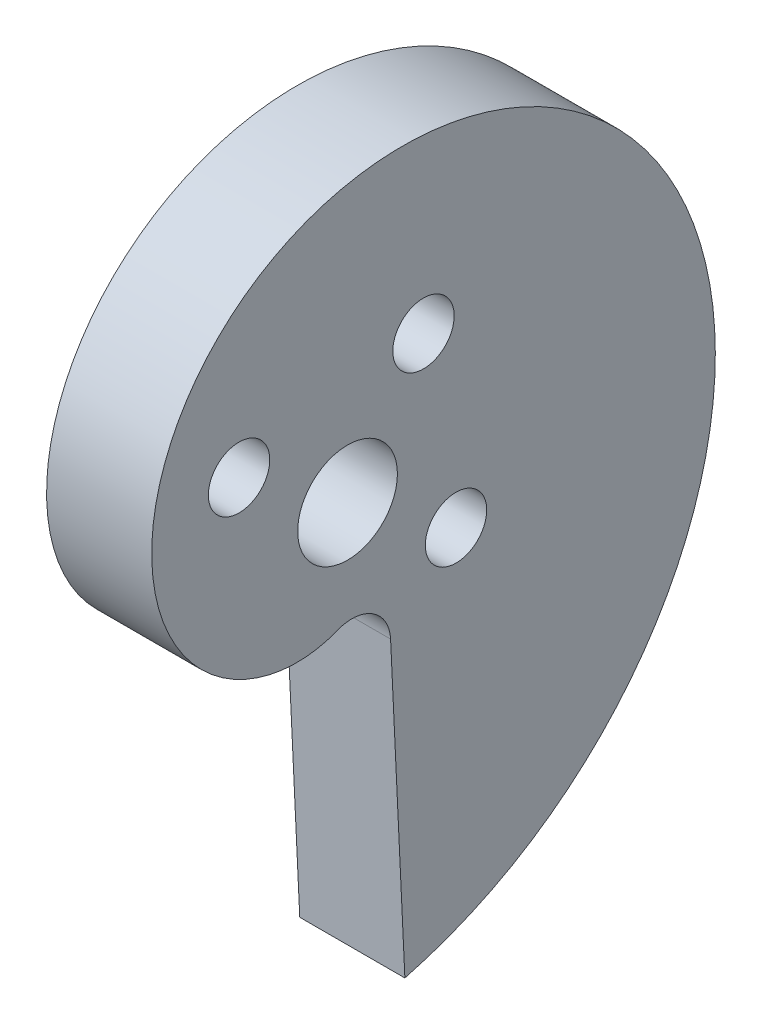
ISO-10303-21;
HEADER;
FILE_DESCRIPTION(('STEP AP214'),'2;1');
FILE_NAME('part.step','',(''),(''),'','','');
FILE_SCHEMA(('AUTOMOTIVE_DESIGN { 1 0 10303 214 1 1 1 1 }'));
ENDSEC;
DATA;
#1=APPLICATION_CONTEXT('core data for automotive mechanical design processes');
#2=APPLICATION_PROTOCOL_DEFINITION('international standard','automotive_design',2000,#1);
#3=PRODUCT_CONTEXT('',#1,'mechanical');
#4=PRODUCT('Part','Part','',(#3));
#5=PRODUCT_RELATED_PRODUCT_CATEGORY('part','',(#4));
#6=PRODUCT_DEFINITION_FORMATION('','',#4);
#7=PRODUCT_DEFINITION_CONTEXT('part definition',#1,'design');
#8=PRODUCT_DEFINITION('design','',#6,#7);
#9=PRODUCT_DEFINITION_SHAPE('','',#8);
#10=(LENGTH_UNIT() NAMED_UNIT(*) SI_UNIT(.MILLI.,.METRE.));
#11=(NAMED_UNIT(*) PLANE_ANGLE_UNIT() SI_UNIT($,.RADIAN.));
#12=(NAMED_UNIT(*) SI_UNIT($,.STERADIAN.) SOLID_ANGLE_UNIT());
#13=UNCERTAINTY_MEASURE_WITH_UNIT(LENGTH_MEASURE(1.E-05),#10,'distance_accuracy_value','');
#14=(GEOMETRIC_REPRESENTATION_CONTEXT(3) GLOBAL_UNCERTAINTY_ASSIGNED_CONTEXT((#13)) GLOBAL_UNIT_ASSIGNED_CONTEXT((#10,
#11,#12)) REPRESENTATION_CONTEXT('',''));
#15=CARTESIAN_POINT('',(0.,0.,0.));
#16=DIRECTION('',(0.,0.,1.));
#17=DIRECTION('',(1.,0.,0.));
#18=AXIS2_PLACEMENT_3D('',#15,#16,#17);
#19=CARTESIAN_POINT('',(6.35,16.3980040897592,0.208936694079273));
#20=DIRECTION('',(1.,0.,0.));
#21=DIRECTION('',(0.,0.,-1.));
#22=AXIS2_PLACEMENT_3D('',#19,#20,#21);
#23=PLANE('',#22);
#24=CARTESIAN_POINT('',(6.35,6.55321635431194,-4.58861149080837));
#25=DIRECTION('',(-1.,0.,0.));
#26=DIRECTION('',(0.,0.,1.));
#27=AXIS2_PLACEMENT_3D('',#24,#25,#26);
#28=CIRCLE('',#27,1.8542);
#29=CARTESIAN_POINT('',(6.35,6.55321635431194,-2.73441149080837));
#30=VERTEX_POINT('',#29);
#31=EDGE_CURVE('E138',#30,#30,#28,.T.);
#32=ORIENTED_EDGE('',*,*,#31,.T.);
#33=EDGE_LOOP('',(#32));
#34=FACE_BOUND('',#33,.T.);
#35=CARTESIAN_POINT('',(6.35,4.58861149080839,6.55321635431194));
#36=DIRECTION('',(-1.,0.,0.));
#37=DIRECTION('',(0.,0.,1.));
#38=AXIS2_PLACEMENT_3D('',#35,#36,#37);
#39=CIRCLE('',#38,1.8542);
#40=CARTESIAN_POINT('',(6.35,4.58861149080839,8.40741635431194));
#41=VERTEX_POINT('',#40);
#42=EDGE_CURVE('E142',#41,#41,#39,.T.);
#43=ORIENTED_EDGE('',*,*,#42,.T.);
#44=EDGE_LOOP('',(#43));
#45=FACE_BOUND('',#44,.T.);
#46=CARTESIAN_POINT('',(6.35,-4.58861149080837,-6.55321635431192));
#47=DIRECTION('',(-1.,0.,0.));
#48=DIRECTION('',(0.,0.,1.));
#49=AXIS2_PLACEMENT_3D('',#46,#47,#48);
#50=CIRCLE('',#49,1.8542);
#51=CARTESIAN_POINT('',(6.35,-4.58861149080837,-4.69901635431192));
#52=VERTEX_POINT('',#51);
#53=EDGE_CURVE('E145',#52,#52,#50,.T.);
#54=ORIENTED_EDGE('',*,*,#53,.T.);
#55=EDGE_LOOP('',(#54));
#56=FACE_BOUND('',#55,.T.);
#57=CARTESIAN_POINT('',(6.35,-26.6041786448891,-3.46411616806894));
#58=CARTESIAN_POINT('',(6.35,-26.5960990181453,-3.49393067135354));
#59=CARTESIAN_POINT('',(6.35,-26.5880156349324,-3.52374410868873));
#60=CARTESIAN_POINT('',(6.35,-26.5718488325451,-3.58337111594988));
#61=CARTESIAN_POINT('',(6.35,-26.5637654133707,-3.61318468587584));
#62=CARTESIAN_POINT('',(6.35,-26.5395261439436,-3.70262963202641));
#63=CARTESIAN_POINT('',(6.35,-26.5233815637382,-3.76226420628094));
#64=CARTESIAN_POINT('',(6.35,-26.4906236526863,-3.88140637873935));
#65=CARTESIAN_POINT('',(6.35,-26.4740103112024,-3.94091397402874));
#66=CARTESIAN_POINT('',(6.35,-26.4403815894244,-4.05981460436438));
#67=CARTESIAN_POINT('',(6.35,-26.4233662121929,-4.11920764027957));
#68=CARTESIAN_POINT('',(6.35,-26.3716923994657,-4.29720938115184));
#69=CARTESIAN_POINT('',(6.35,-26.3364072843143,-4.41563707917067));
#70=CARTESIAN_POINT('',(6.35,-26.2641853845529,-4.6519850599258));
#71=CARTESIAN_POINT('',(6.35,-26.2272486119225,-4.76990534633561));
#72=CARTESIAN_POINT('',(6.35,-26.1139444068046,-5.12293103285834));
#73=CARTESIAN_POINT('',(6.35,-26.0350986002427,-5.35724781947172));
#74=CARTESIAN_POINT('',(6.35,-25.8708563849999,-5.8235592949556));
#75=CARTESIAN_POINT('',(6.35,-25.7854600420231,-6.05555400709093));
#76=CARTESIAN_POINT('',(6.35,-25.5195003139906,-6.74780898379338));
#77=CARTESIAN_POINT('',(6.35,-25.3291595386374,-7.20436094526831));
#78=CARTESIAN_POINT('',(6.35,-24.9225212871115,-8.10647878886224));
#79=CARTESIAN_POINT('',(6.35,-24.7061887301483,-8.55202882213988));
#80=CARTESIAN_POINT('',(6.35,-24.2482870811777,-9.42992884621023));
#81=CARTESIAN_POINT('',(6.35,-24.0067199993427,-9.86227988488946));
#82=CARTESIAN_POINT('',(6.35,-23.499035484093,-10.7123263424163));
#83=CARTESIAN_POINT('',(6.35,-23.2329186005125,-11.1300220892049));
#84=CARTESIAN_POINT('',(6.35,-22.7456402479494,-11.847851602567));
#85=CARTESIAN_POINT('',(6.35,-22.5296437628228,-12.1515056315926));
#86=CARTESIAN_POINT('',(6.35,-22.084413352748,-12.7489932481006));
#87=CARTESIAN_POINT('',(6.35,-21.8551785466971,-13.0428261798607));
#88=CARTESIAN_POINT('',(6.35,-21.3838895241104,-13.620035602395));
#89=CARTESIAN_POINT('',(6.35,-21.141834989919,-13.9034118337705));
#90=CARTESIAN_POINT('',(6.35,-20.6453436861472,-14.4590921821359));
#91=CARTESIAN_POINT('',(6.35,-20.3909071208197,-14.7313964816312));
#92=CARTESIAN_POINT('',(6.35,-19.870311136869,-15.2640889646824));
#93=CARTESIAN_POINT('',(6.35,-19.6041625900917,-15.5244877601765));
#94=CARTESIAN_POINT('',(6.35,-19.0603866610495,-16.0329689554833));
#95=CARTESIAN_POINT('',(6.35,-18.7827592318886,-16.2810513049693));
#96=CARTESIAN_POINT('',(6.35,-17.933432481453,-17.0059312611249));
#97=CARTESIAN_POINT('',(6.35,-17.3451183982972,-17.4635361757599));
#98=CARTESIAN_POINT('',(6.35,-16.1647015449857,-18.2976613403723));
#99=CARTESIAN_POINT('',(6.35,-15.5748340735074,-18.6773591195821));
#100=CARTESIAN_POINT('',(6.35,-14.3640301688315,-19.3835613476243));
#101=CARTESIAN_POINT('',(6.35,-13.7430946848625,-19.7100674203402));
#102=CARTESIAN_POINT('',(6.35,-12.4747331278291,-20.3069368781326));
#103=CARTESIAN_POINT('',(6.35,-11.8273052792346,-20.5772964928467));
#104=CARTESIAN_POINT('',(6.35,-10.5107649849682,-21.0586719994844));
#105=CARTESIAN_POINT('',(6.35,-9.84165333182641,-21.2696900575841));
#106=CARTESIAN_POINT('',(6.35,-8.51931603069606,-21.6215571855532));
#107=CARTESIAN_POINT('',(6.35,-7.86685786047716,-21.7652761257472));
#108=CARTESIAN_POINT('',(6.35,-6.88075589921008,-21.9374607449297));
#109=CARTESIAN_POINT('',(6.35,-6.55078378350999,-21.9876263623933));
#110=CARTESIAN_POINT('',(6.35,-5.88895381514913,-22.0733163220885));
#111=CARTESIAN_POINT('',(6.35,-5.55709595067515,-22.1088405724972));
#112=CARTESIAN_POINT('',(6.35,-4.55979382082403,-22.1932365925857));
#113=CARTESIAN_POINT('',(6.35,-3.89228024143644,-22.2199912172447));
#114=CARTESIAN_POINT('',(6.35,-2.89152295014816,-22.2149934639596));
#115=CARTESIAN_POINT('',(6.35,-2.55798556615433,-22.2058023918767));
#116=CARTESIAN_POINT('',(6.35,-1.89167446294591,-22.1722723503277));
#117=CARTESIAN_POINT('',(6.35,-1.55890073697784,-22.1479335153446));
#118=CARTESIAN_POINT('',(6.35,-0.595715786563489,-22.0553379817985));
#119=CARTESIAN_POINT('',(6.35,0.0329519082644807,-21.9672696384117));
#120=CARTESIAN_POINT('',(6.35,0.968090394017084,-21.7940847068843));
#121=CARTESIAN_POINT('',(6.35,1.27852595277456,-21.7295000942686));
#122=CARTESIAN_POINT('',(6.35,1.89622303880414,-21.5866153495594));
#123=CARTESIAN_POINT('',(6.35,2.20348455851135,-21.5083151847848));
#124=CARTESIAN_POINT('',(6.35,3.11949232688065,-21.2529876735919));
#125=CARTESIAN_POINT('',(6.35,3.72272393447467,-21.0554848603221));
#126=CARTESIAN_POINT('',(6.35,4.61211008989112,-20.7191477551366));
#127=CARTESIAN_POINT('',(6.35,4.90602590174425,-20.600340041007));
#128=CARTESIAN_POINT('',(6.35,5.48814338740102,-20.3494332944114));
#129=CARTESIAN_POINT('',(6.35,5.77634502116379,-20.2173341688482));
#130=CARTESIAN_POINT('',(6.35,6.60155511822596,-19.8159032003133));
#131=CARTESIAN_POINT('',(6.35,7.13040589307388,-19.5295564938876));
#132=CARTESIAN_POINT('',(6.35,8.16081793802565,-18.9114937344462));
#133=CARTESIAN_POINT('',(6.35,8.66238000700598,-18.5797790105786));
#134=CARTESIAN_POINT('',(6.35,9.63370323518806,-17.8727976579963));
#135=CARTESIAN_POINT('',(6.35,10.1034706650373,-17.4975396568974));
#136=CARTESIAN_POINT('',(6.35,11.0071094740781,-16.7060538785788));
#137=CARTESIAN_POINT('',(6.35,11.4409836517707,-16.2898293009652));
#138=CARTESIAN_POINT('',(6.35,12.2455901724637,-15.4431512610323));
#139=CARTESIAN_POINT('',(6.35,12.6184856964032,-15.0147506322602));
#140=CARTESIAN_POINT('',(6.35,13.3251088370727,-14.1266556784948));
#141=CARTESIAN_POINT('',(6.35,13.658837644674,-13.6669623056353));
#142=CARTESIAN_POINT('',(6.35,14.1273347711691,-12.9565066966575));
#143=CARTESIAN_POINT('',(6.35,14.2781567865579,-12.7161917146737));
#144=CARTESIAN_POINT('',(6.35,14.5687526701808,-12.2289769415579));
#145=CARTESIAN_POINT('',(6.35,14.7085275622432,-11.982077763481));
#146=CARTESIAN_POINT('',(6.35,14.976662087067,-11.4822081934086));
#147=CARTESIAN_POINT('',(6.35,15.1050233906383,-11.2292386969412));
#148=CARTESIAN_POINT('',(6.35,15.3500337253178,-10.7175936099666));
#149=CARTESIAN_POINT('',(6.35,15.4666792251924,-10.4589163275719));
#150=CARTESIAN_POINT('',(6.35,15.6813212851905,-9.95180679999024));
#151=CARTESIAN_POINT('',(6.35,15.7800115945683,-9.70366850500394));
#152=CARTESIAN_POINT('',(6.35,15.9663531695722,-9.2032821883138));
#153=CARTESIAN_POINT('',(6.35,16.0540033918904,-8.95103378073715));
#154=CARTESIAN_POINT('',(6.35,16.3000334282841,-8.18886243094257));
#155=CARTESIAN_POINT('',(6.35,16.4415695943575,-7.67333168162063));
#156=CARTESIAN_POINT('',(6.35,16.6185812659381,-6.89232214687901));
#157=CARTESIAN_POINT('',(6.35,16.6717037530089,-6.63069488211353));
#158=CARTESIAN_POINT('',(6.35,16.7659669980484,-6.10528997868587));
#159=CARTESIAN_POINT('',(6.35,16.8071076371406,-5.84151231871546));
#160=CARTESIAN_POINT('',(6.35,16.9123052056012,-5.04776388346588));
#161=CARTESIAN_POINT('',(6.35,16.9581756794004,-4.5152108565262));
#162=CARTESIAN_POINT('',(6.35,16.9889866131176,-3.73188497077908));
#163=CARTESIAN_POINT('',(6.35,16.9933497523758,-3.48170479371437));
#164=CARTESIAN_POINT('',(6.35,16.9910077767209,-2.98139125909959));
#165=CARTESIAN_POINT('',(6.35,16.9843028337307,-2.73125790088262));
#166=CARTESIAN_POINT('',(6.35,16.9474771512814,-1.98170896838924));
#167=CARTESIAN_POINT('',(6.35,16.9006509706288,-1.48300889884048));
#168=CARTESIAN_POINT('',(6.35,16.7621449217171,-0.492050969980706));
#169=CARTESIAN_POINT('',(6.35,16.6704764254929,0.00020849019213582));
#170=CARTESIAN_POINT('',(6.35,16.4420525322467,0.974178631913562));
#171=CARTESIAN_POINT('',(6.35,16.3052998467292,1.45588994600308));
#172=CARTESIAN_POINT('',(6.35,15.9979016234245,2.37265974437791));
#173=CARTESIAN_POINT('',(6.35,15.8301329655558,2.80868423790338));
#174=CARTESIAN_POINT('',(6.35,15.4562265829443,3.66397859957526));
#175=CARTESIAN_POINT('',(6.35,15.2500901712971,4.08324904051499));
#176=CARTESIAN_POINT('',(6.35,14.8006581322923,4.90125114980656));
#177=CARTESIAN_POINT('',(6.35,14.5573729209783,5.29998853358491));
#178=CARTESIAN_POINT('',(6.35,14.0347805079883,6.07310185409697));
#179=CARTESIAN_POINT('',(6.35,13.7554758700731,6.44747952183559));
#180=CARTESIAN_POINT('',(6.35,13.1839183924489,7.14235925341812));
#181=CARTESIAN_POINT('',(6.35,12.8940275022432,7.46479955466107));
#182=CARTESIAN_POINT('',(6.35,12.4384424571224,7.92791034063023));
#183=CARTESIAN_POINT('',(6.35,12.2831032441109,8.07887213844365));
#184=CARTESIAN_POINT('',(6.35,11.9657286963515,8.37357323403963));
#185=CARTESIAN_POINT('',(6.35,11.8036933306129,8.51731249838838));
#186=CARTESIAN_POINT('',(6.35,11.3080343569058,8.93710093457745));
#187=CARTESIAN_POINT('',(6.35,10.9646916643919,9.20188991072441));
#188=CARTESIAN_POINT('',(6.35,10.4324327389453,9.57404235832414));
#189=CARTESIAN_POINT('',(6.35,10.2521216010789,9.69393119674056));
#190=CARTESIAN_POINT('',(6.35,9.88598424193469,9.92497549292142));
#191=CARTESIAN_POINT('',(6.35,9.70015816748061,10.0361311829009));
#192=CARTESIAN_POINT('',(6.35,9.16444116405589,10.3393060660077));
#193=CARTESIAN_POINT('',(6.35,8.80832915226598,10.5204801836729));
#194=CARTESIAN_POINT('',(6.35,8.08132908197637,10.8501433844362));
#195=CARTESIAN_POINT('',(6.35,7.71044060320731,10.9986315371016));
#196=CARTESIAN_POINT('',(6.35,6.95664104338392,11.2610276657326));
#197=CARTESIAN_POINT('',(6.35,6.57373373578024,11.3749463776861));
#198=CARTESIAN_POINT('',(6.35,5.99273470026,11.5183452851603));
#199=CARTESIAN_POINT('',(6.35,5.7979496332391,11.5615669025186));
#200=CARTESIAN_POINT('',(6.35,5.40652321008225,11.6385618313836));
#201=CARTESIAN_POINT('',(6.35,5.20988190770239,11.6723354156404));
#202=CARTESIAN_POINT('',(6.35,4.65033370171099,11.7544105230111));
#203=CARTESIAN_POINT('',(6.35,4.28568497206795,11.7912985181493));
#204=CARTESIAN_POINT('',(6.35,3.55455013605828,11.8318701835188));
#205=CARTESIAN_POINT('',(6.35,3.18806390085958,11.8355514920303));
#206=CARTESIAN_POINT('',(6.35,2.45641583932739,11.8090174666788));
#207=CARTESIAN_POINT('',(6.35,2.09125359671678,11.778813920978));
#208=CARTESIAN_POINT('',(6.35,1.36548059192559,11.6838082483825));
#209=CARTESIAN_POINT('',(6.35,1.00486887674723,11.6190134931392));
#210=CARTESIAN_POINT('',(6.35,0.324307942849594,11.4614382628748));
#211=CARTESIAN_POINT('',(6.35,0.00364406995611465,11.3717401093354));
#212=CARTESIAN_POINT('',(6.35,-0.628147099321365,11.1632867552544));
#213=CARTESIAN_POINT('',(6.35,-0.939273778376596,11.044529678221));
#214=CARTESIAN_POINT('',(6.35,-1.54892201894779,10.7784921512198));
#215=CARTESIAN_POINT('',(6.35,-1.84744907693349,10.6312242987931));
#216=CARTESIAN_POINT('',(6.35,-2.42897758776261,10.3086185913174));
#217=CARTESIAN_POINT('',(6.35,-2.71198222110295,10.1332865156067));
#218=CARTESIAN_POINT('',(6.35,-3.10837977647508,9.85924255327324));
#219=CARTESIAN_POINT('',(6.35,-3.22942542142978,9.77144787341416));
#220=CARTESIAN_POINT('',(6.35,-3.46732952151261,9.59036048217526));
#221=CARTESIAN_POINT('',(6.35,-3.58418806355643,9.4970678850274));
#222=CARTESIAN_POINT('',(6.35,-3.92806004067557,9.20918027089204));
#223=CARTESIAN_POINT('',(6.35,-4.14842759657389,9.00653556116692));
#224=CARTESIAN_POINT('',(6.35,-4.56878919503829,8.58138333255455));
#225=CARTESIAN_POINT('',(6.35,-4.76879483064123,8.35888725296908));
#226=CARTESIAN_POINT('',(6.35,-5.14614206186432,7.89543066389403));
#227=CARTESIAN_POINT('',(6.35,-5.3234875023102,7.65447329791619));
#228=CARTESIAN_POINT('',(6.35,-5.63430947780914,7.18366218799663));
#229=CARTESIAN_POINT('',(6.35,-5.77047423090025,6.95558248768723));
#230=CARTESIAN_POINT('',(6.35,-6.02062257579595,6.48754083821427));
#231=CARTESIAN_POINT('',(6.35,-6.1346071224693,6.24757940112347));
#232=CARTESIAN_POINT('',(6.35,-6.33887912149973,5.75777155134351));
#233=CARTESIAN_POINT('',(6.35,-6.42916767621237,5.50792559911196));
#234=CARTESIAN_POINT('',(6.35,-6.58443349235139,5.00049357965073));
#235=CARTESIAN_POINT('',(6.35,-6.64941442335705,4.74290864040478));
#236=CARTESIAN_POINT('',(6.35,-6.74598736460804,4.25449797920384));
#237=CARTESIAN_POINT('',(6.35,-6.780711824222,4.02429629283166));
#238=CARTESIAN_POINT('',(6.35,-6.81617319998053,3.67733736076881));
#239=CARTESIAN_POINT('',(6.35,-6.82522288289698,3.56139077828091));
#240=CARTESIAN_POINT('',(6.35,-6.83763420983804,3.32919441165276));
#241=CARTESIAN_POINT('',(6.35,-6.84099580829413,3.21294462509094));
#242=CARTESIAN_POINT('',(6.35,-6.84242850832694,2.86488965539435));
#243=CARTESIAN_POINT('',(6.35,-6.83192934168472,2.6329862272909));
#244=CARTESIAN_POINT('',(6.35,-6.78738287473666,2.17159674221351));
#245=CARTESIAN_POINT('',(6.35,-6.75335040877215,1.94210925480276));
#246=CARTESIAN_POINT('',(6.35,-6.66928060603601,1.52806566622524));
#247=CARTESIAN_POINT('',(6.35,-6.62312313736352,1.34272156396831));
#248=CARTESIAN_POINT('',(6.35,-6.51402688183936,0.977073180265552));
#249=CARTESIAN_POINT('',(6.35,-6.45108967798272,0.796768425181119));
#250=CARTESIAN_POINT('',(6.35,-6.37955418312461,0.619822850888123));
#251=B_SPLINE_CURVE_WITH_KNOTS('',3,(#57,#58,#59,#60,#61,#62,#63,#64,#65,#66,#67,#68,#69,#70,
#71,#72,#73,#74,#75,#76,#77,#78,#79,#80,#81,#82,#83,#84,#85,#86,#87,#88,#89,#90,#91,#92,#93,#94,
#95,#96,#97,#98,#99,#100,#101,#102,#103,#104,#105,#106,#107,#108,#109,#110,#111,#112,#113,#114,
#115,#116,#117,#118,#119,#120,#121,#122,#123,#124,#125,#126,#127,#128,#129,#130,#131,#132,#133,
#134,#135,#136,#137,#138,#139,#140,#141,#142,#143,#144,#145,#146,#147,#148,#149,#150,#151,#152,
#153,#154,#155,#156,#157,#158,#159,#160,#161,#162,#163,#164,#165,#166,#167,#168,#169,#170,#171,
#172,#173,#174,#175,#176,#177,#178,#179,#180,#181,#182,#183,#184,#185,#186,#187,#188,#189,#190,
#191,#192,#193,#194,#195,#196,#197,#198,#199,#200,#201,#202,#203,#204,#205,#206,#207,#208,#209,
#210,#211,#212,#213,#214,#215,#216,#217,#218,#219,#220,#221,#222,#223,#224,#225,#226,#227,#228,
#229,#230,#231,#232,#233,#234,#235,#236,#237,#238,#239,#240,#241,#242,#243,#244,#245,#246,#247,
#248,#249,#250),.UNSPECIFIED.,.F.,.F.,(4,2,2,2,2,2,2,2,2,2,2,2,2,2,2,2,2,2,2,2,2,2,2,2,2,2,2,2,
2,2,2,2,2,2,2,2,2,2,2,2,2,2,2,2,2,2,2,2,2,2,2,2,2,2,2,2,2,2,2,2,2,2,2,2,2,2,2,2,2,2,2,2,2,2,2,2,
2,2,2,2,2,2,2,2,2,2,2,2,2,2,2,2,2,2,2,2,4),(0.,0.0926695617352574,0.185339535614265,
0.370682711215113,0.556030096112552,0.741376069577325,1.1120793414309,1.48277992497415,
2.2243479758606,2.96590858953527,4.44896419863202,5.93404444342148,7.41900647738353,
8.90393526118761,10.0215131922545,11.1391655918504,12.2568456983469,13.3745073739483,
14.4911525872986,15.6078023630403,17.8403733209062,19.942329574827,22.0442216463401,
24.1462548190774,26.2482112502258,28.2497809593054,29.2507798930136,30.2517851043673,
32.2527611602103,33.2534722057809,34.2541743670945,36.1557427204534,37.1067331856918,
38.0577259169634,39.9589143278495,40.9097121227251,41.8605165777567,43.6622308050559,
45.4638922587852,47.265197340965,49.0663618475696,50.7681276305578,52.4698416576219,
53.3207700719231,54.1716195309475,55.0223442302499,55.8733245798795,56.6741831513156,
57.475117348612,59.0763957503357,59.8770662248953,60.6777446429507,62.2785901719909,
63.0290553534382,63.7795088778617,65.2800101467939,66.7801310849274,68.2801618175425,
69.6799153349475,71.0796209560827,72.4789348360549,73.8781491717417,75.1771008636637,
75.8267289281718,76.4763599995956,77.7749132133461,78.4243090869169,79.0736876871546,
80.2706163235864,81.4675790271636,82.6641696171176,83.2625396804237,83.860892467929,
84.9588208120137,86.0568272421415,87.154451806521,88.2518425520269,89.2493967940745,
90.2470154706009,91.2441943493013,92.24116813994,92.6896317930356,93.1380861315428,
94.0347850469901,94.9309705386994,95.8270037693383,96.622784174215,97.418530312772,
98.2142394260493,99.009833119334,99.7071699333863,100.055943118078,100.404719096858,
101.099890942744,101.794624982317,102.366866921723,102.939054895092),.UNSPECIFIED.);
#252=CARTESIAN_POINT('',(6.35,-26.6041786448891,-3.46411616806894));
#253=VERTEX_POINT('',#252);
#254=CARTESIAN_POINT('',(6.35,-6.37955418312461,0.619822850888123));
#255=VERTEX_POINT('',#254);
#256=EDGE_CURVE('E117',#253,#255,#251,.T.);
#257=ORIENTED_EDGE('',*,*,#256,.T.);
#258=CARTESIAN_POINT('',(6.35,-8.55278837318837,-0.259188983321581));
#259=DIRECTION('',(1.,0.,0.));
#260=DIRECTION('',(0.,0.,-1.));
#261=AXIS2_PLACEMENT_3D('',#258,#259,#260);
#262=CIRCLE('',#261,2.34427145389411);
#263=CARTESIAN_POINT('',(6.35,-8.44148736532646,-2.60081677936256));
#264=VERTEX_POINT('',#263);
#265=EDGE_CURVE('E39',#255,#264,#262,.F.);
#266=ORIENTED_EDGE('',*,*,#265,.T.);
#267=DIRECTION('',(0.,-0.998872290216758,-0.0474778668131734));
#268=VECTOR('',#267,1.);
#269=CARTESIAN_POINT('',(6.35,-26.3357339713737,-3.45135659852166));
#270=LINE('',#269,#268);
#271=EDGE_CURVE('E53',#264,#253,#270,.T.);
#272=ORIENTED_EDGE('',*,*,#271,.T.);
#273=EDGE_LOOP('',(#257,#266,#272));
#274=FACE_BOUND('',#273,.T.);
#275=CARTESIAN_POINT('',(6.35,0.,0.));
#276=DIRECTION('',(1.,0.,0.));
#277=DIRECTION('',(0.,0.,-1.));
#278=AXIS2_PLACEMENT_3D('',#275,#276,#277);
#279=CIRCLE('',#278,3.012699969);
#280=CARTESIAN_POINT('',(6.35,0.,-3.012699969));
#281=VERTEX_POINT('',#280);
#282=EDGE_CURVE('E86',#281,#281,#279,.T.);
#283=ORIENTED_EDGE('',*,*,#282,.F.);
#284=EDGE_LOOP('',(#283));
#285=FACE_BOUND('',#284,.T.);
#286=ADVANCED_FACE('F35',(#34,#45,#56,#274,#285),#23,.T.);
#287=CARTESIAN_POINT('',(0.,16.3980040897592,0.208936694079273));
#288=DIRECTION('',(1.,0.,0.));
#289=DIRECTION('',(0.,0.,-1.));
#290=AXIS2_PLACEMENT_3D('',#287,#288,#289);
#291=PLANE('',#290);
#292=CARTESIAN_POINT('',(0.,6.55321635431194,-4.58861149080837));
#293=DIRECTION('',(-1.,0.,0.));
#294=DIRECTION('',(0.,0.,1.));
#295=AXIS2_PLACEMENT_3D('',#292,#293,#294);
#296=CIRCLE('',#295,1.8542);
#297=CARTESIAN_POINT('',(0.,6.55321635431194,-2.73441149080837));
#298=VERTEX_POINT('',#297);
#299=EDGE_CURVE('E157',#298,#298,#296,.T.);
#300=ORIENTED_EDGE('',*,*,#299,.F.);
#301=EDGE_LOOP('',(#300));
#302=FACE_BOUND('',#301,.T.);
#303=CARTESIAN_POINT('',(0.,4.58861149080839,6.55321635431194));
#304=DIRECTION('',(-1.,0.,0.));
#305=DIRECTION('',(0.,0.,1.));
#306=AXIS2_PLACEMENT_3D('',#303,#304,#305);
#307=CIRCLE('',#306,1.8542);
#308=CARTESIAN_POINT('',(0.,4.58861149080839,8.40741635431194));
#309=VERTEX_POINT('',#308);
#310=EDGE_CURVE('E153',#309,#309,#307,.T.);
#311=ORIENTED_EDGE('',*,*,#310,.F.);
#312=EDGE_LOOP('',(#311));
#313=FACE_BOUND('',#312,.T.);
#314=CARTESIAN_POINT('',(0.,-4.58861149080837,-6.55321635431192));
#315=DIRECTION('',(-1.,0.,0.));
#316=DIRECTION('',(0.,0.,1.));
#317=AXIS2_PLACEMENT_3D('',#314,#315,#316);
#318=CIRCLE('',#317,1.8542);
#319=CARTESIAN_POINT('',(0.,-4.58861149080837,-4.69901635431192));
#320=VERTEX_POINT('',#319);
#321=EDGE_CURVE('E147',#320,#320,#318,.T.);
#322=ORIENTED_EDGE('',*,*,#321,.F.);
#323=EDGE_LOOP('',(#322));
#324=FACE_BOUND('',#323,.T.);
#325=CARTESIAN_POINT('',(0.,-26.6041786448891,-3.46411616806894));
#326=CARTESIAN_POINT('',(0.,-26.5960990181453,-3.49393067135354));
#327=CARTESIAN_POINT('',(0.,-26.5880156349324,-3.52374410868873));
#328=CARTESIAN_POINT('',(0.,-26.5718488325451,-3.58337111594988));
#329=CARTESIAN_POINT('',(0.,-26.5637654133707,-3.61318468587584));
#330=CARTESIAN_POINT('',(0.,-26.5395261439436,-3.70262963202641));
#331=CARTESIAN_POINT('',(0.,-26.5233815637382,-3.76226420628094));
#332=CARTESIAN_POINT('',(0.,-26.4906236526863,-3.88140637873935));
#333=CARTESIAN_POINT('',(0.,-26.4740103112024,-3.94091397402874));
#334=CARTESIAN_POINT('',(0.,-26.4403815894244,-4.05981460436438));
#335=CARTESIAN_POINT('',(0.,-26.4233662121929,-4.11920764027957));
#336=CARTESIAN_POINT('',(0.,-26.3716923994657,-4.29720938115184));
#337=CARTESIAN_POINT('',(0.,-26.3364072843143,-4.41563707917067));
#338=CARTESIAN_POINT('',(0.,-26.2641853845529,-4.6519850599258));
#339=CARTESIAN_POINT('',(0.,-26.2272486119225,-4.76990534633561));
#340=CARTESIAN_POINT('',(0.,-26.1139444068046,-5.12293103285834));
#341=CARTESIAN_POINT('',(0.,-26.0350986002427,-5.35724781947172));
#342=CARTESIAN_POINT('',(0.,-25.8708563849999,-5.8235592949556));
#343=CARTESIAN_POINT('',(0.,-25.7854600420231,-6.05555400709093));
#344=CARTESIAN_POINT('',(0.,-25.5195003139906,-6.74780898379338));
#345=CARTESIAN_POINT('',(0.,-25.3291595386374,-7.20436094526831));
#346=CARTESIAN_POINT('',(0.,-24.9225212871115,-8.10647878886224));
#347=CARTESIAN_POINT('',(0.,-24.7061887301483,-8.55202882213988));
#348=CARTESIAN_POINT('',(0.,-24.2482870811777,-9.42992884621023));
#349=CARTESIAN_POINT('',(0.,-24.0067199993427,-9.86227988488946));
#350=CARTESIAN_POINT('',(0.,-23.499035484093,-10.7123263424163));
#351=CARTESIAN_POINT('',(0.,-23.2329186005125,-11.1300220892049));
#352=CARTESIAN_POINT('',(0.,-22.7456402479494,-11.847851602567));
#353=CARTESIAN_POINT('',(0.,-22.5296437628228,-12.1515056315926));
#354=CARTESIAN_POINT('',(0.,-22.084413352748,-12.7489932481006));
#355=CARTESIAN_POINT('',(0.,-21.8551785466971,-13.0428261798607));
#356=CARTESIAN_POINT('',(0.,-21.3838895241104,-13.620035602395));
#357=CARTESIAN_POINT('',(0.,-21.141834989919,-13.9034118337705));
#358=CARTESIAN_POINT('',(0.,-20.6453436861472,-14.4590921821359));
#359=CARTESIAN_POINT('',(0.,-20.3909071208197,-14.7313964816312));
#360=CARTESIAN_POINT('',(0.,-19.870311136869,-15.2640889646824));
#361=CARTESIAN_POINT('',(0.,-19.6041625900917,-15.5244877601765));
#362=CARTESIAN_POINT('',(0.,-19.0603866610495,-16.0329689554833));
#363=CARTESIAN_POINT('',(0.,-18.7827592318886,-16.2810513049693));
#364=CARTESIAN_POINT('',(0.,-17.933432481453,-17.0059312611249));
#365=CARTESIAN_POINT('',(0.,-17.3451183982972,-17.4635361757599));
#366=CARTESIAN_POINT('',(0.,-16.1647015449857,-18.2976613403723));
#367=CARTESIAN_POINT('',(0.,-15.5748340735074,-18.6773591195821));
#368=CARTESIAN_POINT('',(0.,-14.3640301688315,-19.3835613476243));
#369=CARTESIAN_POINT('',(0.,-13.7430946848625,-19.7100674203402));
#370=CARTESIAN_POINT('',(0.,-12.4747331278291,-20.3069368781326));
#371=CARTESIAN_POINT('',(0.,-11.8273052792346,-20.5772964928467));
#372=CARTESIAN_POINT('',(0.,-10.5107649849682,-21.0586719994844));
#373=CARTESIAN_POINT('',(0.,-9.84165333182641,-21.2696900575841));
#374=CARTESIAN_POINT('',(0.,-8.51931603069606,-21.6215571855532));
#375=CARTESIAN_POINT('',(0.,-7.86685786047716,-21.7652761257472));
#376=CARTESIAN_POINT('',(0.,-6.88075589921008,-21.9374607449297));
#377=CARTESIAN_POINT('',(0.,-6.55078378350999,-21.9876263623933));
#378=CARTESIAN_POINT('',(0.,-5.88895381514913,-22.0733163220885));
#379=CARTESIAN_POINT('',(0.,-5.55709595067515,-22.1088405724972));
#380=CARTESIAN_POINT('',(0.,-4.55979382082403,-22.1932365925857));
#381=CARTESIAN_POINT('',(0.,-3.89228024143644,-22.2199912172447));
#382=CARTESIAN_POINT('',(0.,-2.89152295014816,-22.2149934639596));
#383=CARTESIAN_POINT('',(0.,-2.55798556615433,-22.2058023918767));
#384=CARTESIAN_POINT('',(0.,-1.89167446294591,-22.1722723503277));
#385=CARTESIAN_POINT('',(0.,-1.55890073697784,-22.1479335153446));
#386=CARTESIAN_POINT('',(0.,-0.595715786563489,-22.0553379817985));
#387=CARTESIAN_POINT('',(0.,0.0329519082644807,-21.9672696384117));
#388=CARTESIAN_POINT('',(0.,0.968090394017084,-21.7940847068843));
#389=CARTESIAN_POINT('',(0.,1.27852595277456,-21.7295000942686));
#390=CARTESIAN_POINT('',(0.,1.89622303880414,-21.5866153495594));
#391=CARTESIAN_POINT('',(0.,2.20348455851135,-21.5083151847848));
#392=CARTESIAN_POINT('',(0.,3.11949232688065,-21.2529876735919));
#393=CARTESIAN_POINT('',(0.,3.72272393447467,-21.0554848603221));
#394=CARTESIAN_POINT('',(0.,4.61211008989112,-20.7191477551366));
#395=CARTESIAN_POINT('',(0.,4.90602590174425,-20.600340041007));
#396=CARTESIAN_POINT('',(0.,5.48814338740102,-20.3494332944114));
#397=CARTESIAN_POINT('',(0.,5.77634502116379,-20.2173341688482));
#398=CARTESIAN_POINT('',(0.,6.60155511822596,-19.8159032003133));
#399=CARTESIAN_POINT('',(0.,7.13040589307388,-19.5295564938876));
#400=CARTESIAN_POINT('',(0.,8.16081793802565,-18.9114937344462));
#401=CARTESIAN_POINT('',(0.,8.66238000700598,-18.5797790105786));
#402=CARTESIAN_POINT('',(0.,9.63370323518806,-17.8727976579963));
#403=CARTESIAN_POINT('',(0.,10.1034706650373,-17.4975396568974));
#404=CARTESIAN_POINT('',(0.,11.0071094740781,-16.7060538785788));
#405=CARTESIAN_POINT('',(0.,11.4409836517707,-16.2898293009652));
#406=CARTESIAN_POINT('',(0.,12.2455901724637,-15.4431512610323));
#407=CARTESIAN_POINT('',(0.,12.6184856964032,-15.0147506322602));
#408=CARTESIAN_POINT('',(0.,13.3251088370727,-14.1266556784948));
#409=CARTESIAN_POINT('',(0.,13.658837644674,-13.6669623056353));
#410=CARTESIAN_POINT('',(0.,14.1273347711691,-12.9565066966575));
#411=CARTESIAN_POINT('',(0.,14.2781567865579,-12.7161917146737));
#412=CARTESIAN_POINT('',(0.,14.5687526701808,-12.2289769415579));
#413=CARTESIAN_POINT('',(0.,14.7085275622432,-11.982077763481));
#414=CARTESIAN_POINT('',(0.,14.976662087067,-11.4822081934086));
#415=CARTESIAN_POINT('',(0.,15.1050233906383,-11.2292386969412));
#416=CARTESIAN_POINT('',(0.,15.3500337253178,-10.7175936099666));
#417=CARTESIAN_POINT('',(0.,15.4666792251924,-10.4589163275719));
#418=CARTESIAN_POINT('',(0.,15.6813212851905,-9.95180679999024));
#419=CARTESIAN_POINT('',(0.,15.7800115945683,-9.70366850500394));
#420=CARTESIAN_POINT('',(0.,15.9663531695722,-9.2032821883138));
#421=CARTESIAN_POINT('',(0.,16.0540033918904,-8.95103378073715));
#422=CARTESIAN_POINT('',(0.,16.3000334282841,-8.18886243094257));
#423=CARTESIAN_POINT('',(0.,16.4415695943575,-7.67333168162063));
#424=CARTESIAN_POINT('',(0.,16.6185812659381,-6.89232214687901));
#425=CARTESIAN_POINT('',(0.,16.6717037530089,-6.63069488211353));
#426=CARTESIAN_POINT('',(0.,16.7659669980484,-6.10528997868587));
#427=CARTESIAN_POINT('',(0.,16.8071076371406,-5.84151231871546));
#428=CARTESIAN_POINT('',(0.,16.9123052056012,-5.04776388346588));
#429=CARTESIAN_POINT('',(0.,16.9581756794004,-4.5152108565262));
#430=CARTESIAN_POINT('',(0.,16.9889866131176,-3.73188497077908));
#431=CARTESIAN_POINT('',(0.,16.9933497523758,-3.48170479371437));
#432=CARTESIAN_POINT('',(0.,16.9910077767209,-2.98139125909959));
#433=CARTESIAN_POINT('',(0.,16.9843028337307,-2.73125790088262));
#434=CARTESIAN_POINT('',(0.,16.9474771512814,-1.98170896838924));
#435=CARTESIAN_POINT('',(0.,16.9006509706288,-1.48300889884048));
#436=CARTESIAN_POINT('',(0.,16.7621449217171,-0.492050969980706));
#437=CARTESIAN_POINT('',(0.,16.6704764254929,0.00020849019213582));
#438=CARTESIAN_POINT('',(0.,16.4420525322467,0.974178631913562));
#439=CARTESIAN_POINT('',(0.,16.3052998467292,1.45588994600308));
#440=CARTESIAN_POINT('',(0.,15.9979016234245,2.37265974437791));
#441=CARTESIAN_POINT('',(0.,15.8301329655558,2.80868423790338));
#442=CARTESIAN_POINT('',(0.,15.4562265829443,3.66397859957526));
#443=CARTESIAN_POINT('',(0.,15.2500901712971,4.08324904051499));
#444=CARTESIAN_POINT('',(0.,14.8006581322923,4.90125114980656));
#445=CARTESIAN_POINT('',(0.,14.5573729209783,5.29998853358491));
#446=CARTESIAN_POINT('',(0.,14.0347805079883,6.07310185409697));
#447=CARTESIAN_POINT('',(0.,13.7554758700731,6.44747952183559));
#448=CARTESIAN_POINT('',(0.,13.1839183924489,7.14235925341812));
#449=CARTESIAN_POINT('',(0.,12.8940275022432,7.46479955466107));
#450=CARTESIAN_POINT('',(0.,12.4384424571224,7.92791034063023));
#451=CARTESIAN_POINT('',(0.,12.2831032441109,8.07887213844365));
#452=CARTESIAN_POINT('',(0.,11.9657286963515,8.37357323403963));
#453=CARTESIAN_POINT('',(0.,11.8036933306129,8.51731249838838));
#454=CARTESIAN_POINT('',(0.,11.3080343569058,8.93710093457745));
#455=CARTESIAN_POINT('',(0.,10.9646916643919,9.20188991072441));
#456=CARTESIAN_POINT('',(0.,10.4324327389453,9.57404235832414));
#457=CARTESIAN_POINT('',(0.,10.2521216010789,9.69393119674056));
#458=CARTESIAN_POINT('',(0.,9.88598424193469,9.92497549292142));
#459=CARTESIAN_POINT('',(0.,9.70015816748061,10.0361311829009));
#460=CARTESIAN_POINT('',(0.,9.16444116405589,10.3393060660077));
#461=CARTESIAN_POINT('',(0.,8.80832915226598,10.5204801836729));
#462=CARTESIAN_POINT('',(0.,8.08132908197637,10.8501433844362));
#463=CARTESIAN_POINT('',(0.,7.71044060320731,10.9986315371016));
#464=CARTESIAN_POINT('',(0.,6.95664104338392,11.2610276657326));
#465=CARTESIAN_POINT('',(0.,6.57373373578024,11.3749463776861));
#466=CARTESIAN_POINT('',(0.,5.99273470026,11.5183452851603));
#467=CARTESIAN_POINT('',(0.,5.7979496332391,11.5615669025186));
#468=CARTESIAN_POINT('',(0.,5.40652321008225,11.6385618313836));
#469=CARTESIAN_POINT('',(0.,5.20988190770239,11.6723354156404));
#470=CARTESIAN_POINT('',(0.,4.65033370171099,11.7544105230111));
#471=CARTESIAN_POINT('',(0.,4.28568497206795,11.7912985181493));
#472=CARTESIAN_POINT('',(0.,3.55455013605828,11.8318701835188));
#473=CARTESIAN_POINT('',(0.,3.18806390085958,11.8355514920303));
#474=CARTESIAN_POINT('',(0.,2.45641583932739,11.8090174666788));
#475=CARTESIAN_POINT('',(0.,2.09125359671678,11.778813920978));
#476=CARTESIAN_POINT('',(0.,1.36548059192559,11.6838082483825));
#477=CARTESIAN_POINT('',(0.,1.00486887674723,11.6190134931392));
#478=CARTESIAN_POINT('',(0.,0.324307942849594,11.4614382628748));
#479=CARTESIAN_POINT('',(0.,0.00364406995611465,11.3717401093354));
#480=CARTESIAN_POINT('',(0.,-0.628147099321365,11.1632867552544));
#481=CARTESIAN_POINT('',(0.,-0.939273778376596,11.044529678221));
#482=CARTESIAN_POINT('',(0.,-1.54892201894779,10.7784921512198));
#483=CARTESIAN_POINT('',(0.,-1.84744907693349,10.6312242987931));
#484=CARTESIAN_POINT('',(0.,-2.42897758776261,10.3086185913174));
#485=CARTESIAN_POINT('',(0.,-2.71198222110295,10.1332865156067));
#486=CARTESIAN_POINT('',(0.,-3.10837977647508,9.85924255327324));
#487=CARTESIAN_POINT('',(0.,-3.22942542142978,9.77144787341416));
#488=CARTESIAN_POINT('',(0.,-3.46732952151261,9.59036048217526));
#489=CARTESIAN_POINT('',(0.,-3.58418806355643,9.4970678850274));
#490=CARTESIAN_POINT('',(0.,-3.92806004067557,9.20918027089204));
#491=CARTESIAN_POINT('',(0.,-4.14842759657389,9.00653556116692));
#492=CARTESIAN_POINT('',(0.,-4.56878919503829,8.58138333255455));
#493=CARTESIAN_POINT('',(0.,-4.76879483064123,8.35888725296908));
#494=CARTESIAN_POINT('',(0.,-5.14614206186432,7.89543066389403));
#495=CARTESIAN_POINT('',(0.,-5.3234875023102,7.65447329791619));
#496=CARTESIAN_POINT('',(0.,-5.63430947780914,7.18366218799663));
#497=CARTESIAN_POINT('',(0.,-5.77047423090025,6.95558248768723));
#498=CARTESIAN_POINT('',(0.,-6.02062257579595,6.48754083821427));
#499=CARTESIAN_POINT('',(0.,-6.1346071224693,6.24757940112347));
#500=CARTESIAN_POINT('',(0.,-6.33887912149973,5.75777155134351));
#501=CARTESIAN_POINT('',(0.,-6.42916767621237,5.50792559911196));
#502=CARTESIAN_POINT('',(0.,-6.58443349235139,5.00049357965073));
#503=CARTESIAN_POINT('',(0.,-6.64941442335705,4.74290864040478));
#504=CARTESIAN_POINT('',(0.,-6.74598736460804,4.25449797920384));
#505=CARTESIAN_POINT('',(0.,-6.780711824222,4.02429629283166));
#506=CARTESIAN_POINT('',(0.,-6.81617319998053,3.67733736076881));
#507=CARTESIAN_POINT('',(0.,-6.82522288289698,3.56139077828091));
#508=CARTESIAN_POINT('',(0.,-6.83763420983804,3.32919441165276));
#509=CARTESIAN_POINT('',(0.,-6.84099580829413,3.21294462509094));
#510=CARTESIAN_POINT('',(0.,-6.84242850832694,2.86488965539435));
#511=CARTESIAN_POINT('',(0.,-6.83192934168472,2.6329862272909));
#512=CARTESIAN_POINT('',(0.,-6.78738287473666,2.17159674221351));
#513=CARTESIAN_POINT('',(0.,-6.75335040877215,1.94210925480276));
#514=CARTESIAN_POINT('',(0.,-6.66928060603601,1.52806566622524));
#515=CARTESIAN_POINT('',(0.,-6.62312313736352,1.34272156396831));
#516=CARTESIAN_POINT('',(0.,-6.51402688183936,0.977073180265552));
#517=CARTESIAN_POINT('',(0.,-6.45108967798272,0.796768425181119));
#518=CARTESIAN_POINT('',(0.,-6.37955418312461,0.619822850888123));
#519=B_SPLINE_CURVE_WITH_KNOTS('',3,(#325,#326,#327,#328,#329,#330,#331,#332,#333,#334,#335,
#336,#337,#338,#339,#340,#341,#342,#343,#344,#345,#346,#347,#348,#349,#350,#351,#352,#353,#354,
#355,#356,#357,#358,#359,#360,#361,#362,#363,#364,#365,#366,#367,#368,#369,#370,#371,#372,#373,
#374,#375,#376,#377,#378,#379,#380,#381,#382,#383,#384,#385,#386,#387,#388,#389,#390,#391,#392,
#393,#394,#395,#396,#397,#398,#399,#400,#401,#402,#403,#404,#405,#406,#407,#408,#409,#410,#411,
#412,#413,#414,#415,#416,#417,#418,#419,#420,#421,#422,#423,#424,#425,#426,#427,#428,#429,#430,
#431,#432,#433,#434,#435,#436,#437,#438,#439,#440,#441,#442,#443,#444,#445,#446,#447,#448,#449,
#450,#451,#452,#453,#454,#455,#456,#457,#458,#459,#460,#461,#462,#463,#464,#465,#466,#467,#468,
#469,#470,#471,#472,#473,#474,#475,#476,#477,#478,#479,#480,#481,#482,#483,#484,#485,#486,#487,
#488,#489,#490,#491,#492,#493,#494,#495,#496,#497,#498,#499,#500,#501,#502,#503,#504,#505,#506,
#507,#508,#509,#510,#511,#512,#513,#514,#515,#516,#517,#518),.UNSPECIFIED.,.F.,.F.,(4,2,2,2,2,2,
2,2,2,2,2,2,2,2,2,2,2,2,2,2,2,2,2,2,2,2,2,2,2,2,2,2,2,2,2,2,2,2,2,2,2,2,2,2,2,2,2,2,2,2,2,2,2,2,
2,2,2,2,2,2,2,2,2,2,2,2,2,2,2,2,2,2,2,2,2,2,2,2,2,2,2,2,2,2,2,2,2,2,2,2,2,2,2,2,2,2,4),(0.,
0.0926695617352574,0.185339535614265,0.370682711215113,0.556030096112552,0.741376069577325,
1.1120793414309,1.48277992497415,2.2243479758606,2.96590858953527,4.44896419863202,
5.93404444342148,7.41900647738353,8.90393526118761,10.0215131922545,11.1391655918504,
12.2568456983469,13.3745073739483,14.4911525872986,15.6078023630403,17.8403733209062,
19.942329574827,22.0442216463401,24.1462548190774,26.2482112502258,28.2497809593054,
29.2507798930136,30.2517851043673,32.2527611602103,33.2534722057809,34.2541743670945,
36.1557427204534,37.1067331856918,38.0577259169634,39.9589143278495,40.9097121227251,
41.8605165777567,43.6622308050559,45.4638922587852,47.265197340965,49.0663618475696,
50.7681276305578,52.4698416576219,53.3207700719231,54.1716195309475,55.0223442302499,
55.8733245798795,56.6741831513156,57.475117348612,59.0763957503357,59.8770662248953,
60.6777446429507,62.2785901719909,63.0290553534382,63.7795088778617,65.2800101467939,
66.7801310849274,68.2801618175425,69.6799153349475,71.0796209560827,72.4789348360549,
73.8781491717417,75.1771008636637,75.8267289281718,76.4763599995956,77.7749132133461,
78.4243090869169,79.0736876871546,80.2706163235864,81.4675790271636,82.6641696171176,
83.2625396804237,83.860892467929,84.9588208120137,86.0568272421415,87.154451806521,
88.2518425520269,89.2493967940745,90.2470154706009,91.2441943493013,92.24116813994,
92.6896317930356,93.1380861315428,94.0347850469901,94.9309705386994,95.8270037693383,
96.622784174215,97.418530312772,98.2142394260493,99.009833119334,99.7071699333863,
100.055943118078,100.404719096858,101.099890942744,101.794624982317,102.366866921723,
102.939054895092),.UNSPECIFIED.);
#520=CARTESIAN_POINT('',(0.,-26.6041786448891,-3.46411616806894));
#521=VERTEX_POINT('',#520);
#522=CARTESIAN_POINT('',(0.,-6.37955418312461,0.619822850888123));
#523=VERTEX_POINT('',#522);
#524=EDGE_CURVE('E79',#521,#523,#519,.T.);
#525=ORIENTED_EDGE('',*,*,#524,.F.);
#526=DIRECTION('',(0.,-0.998872290216758,-0.0474778668131734));
#527=VECTOR('',#526,1.);
#528=CARTESIAN_POINT('',(0.,-26.3357339713737,-3.45135659852166));
#529=LINE('',#528,#527);
#530=CARTESIAN_POINT('',(0.,-8.44148736532646,-2.60081677936256));
#531=VERTEX_POINT('',#530);
#532=EDGE_CURVE('E67',#531,#521,#529,.T.);
#533=ORIENTED_EDGE('',*,*,#532,.F.);
#534=CARTESIAN_POINT('',(0.,-8.55278837318837,-0.259188983321581));
#535=DIRECTION('',(1.,0.,0.));
#536=DIRECTION('',(0.,0.,-1.));
#537=AXIS2_PLACEMENT_3D('',#534,#535,#536);
#538=CIRCLE('',#537,2.34427145389411);
#539=EDGE_CURVE('E73',#523,#531,#538,.F.);
#540=ORIENTED_EDGE('',*,*,#539,.F.);
#541=EDGE_LOOP('',(#525,#533,#540));
#542=FACE_BOUND('',#541,.T.);
#543=CARTESIAN_POINT('',(0.,0.,0.));
#544=DIRECTION('',(1.,0.,0.));
#545=DIRECTION('',(0.,0.,-1.));
#546=AXIS2_PLACEMENT_3D('',#543,#544,#545);
#547=CIRCLE('',#546,3.012699969);
#548=CARTESIAN_POINT('',(0.,0.,-3.012699969));
#549=VERTEX_POINT('',#548);
#550=EDGE_CURVE('E89',#549,#549,#547,.T.);
#551=ORIENTED_EDGE('',*,*,#550,.T.);
#552=EDGE_LOOP('',(#551));
#553=FACE_BOUND('',#552,.T.);
#554=ADVANCED_FACE('F76',(#302,#313,#324,#542,#553),#291,.F.);
#555=CARTESIAN_POINT('',(6.35,-26.7483319063098,-2.10718755279176));
#556=CARTESIAN_POINT('',(6.35,-26.6073824375161,-2.62712941052099));
#557=CARTESIAN_POINT('',(6.35,-26.4664329687224,-3.14707126825022));
#558=CARTESIAN_POINT('',(6.35,-25.8850164099486,-5.29183143138332));
#559=CARTESIAN_POINT('',(6.35,-25.2937709802203,-6.85500985861185));
#560=CARTESIAN_POINT('',(6.35,-23.8451939849136,-9.80629411018198));
#561=CARTESIAN_POINT('',(6.35,-22.9879265697091,-11.1943493778112));
#562=CARTESIAN_POINT('',(6.35,-21.0514010056648,-13.7523524342122));
#563=CARTESIAN_POINT('',(6.35,-19.9722145165317,-14.9222640436458));
#564=CARTESIAN_POINT('',(6.35,-17.6424148443339,-17.0111362692066));
#565=CARTESIAN_POINT('',(6.35,-16.3918777440894,-17.9300760548234));
#566=CARTESIAN_POINT('',(6.35,-13.774181132005,-19.4952108297215));
#567=CARTESIAN_POINT('',(6.35,-12.4070989510175,-20.1414006679111));
#568=CARTESIAN_POINT('',(6.35,-9.61304301680638,-21.1506818581234));
#569=CARTESIAN_POINT('',(6.35,-8.18614470800054,-21.5137834309209));
#570=CARTESIAN_POINT('',(6.35,-5.3288100875924,-21.9578966574969));
#571=CARTESIAN_POINT('',(6.35,-3.8984443651538,-22.038932986476));
#572=CARTESIAN_POINT('',(6.35,-1.08794928189315,-21.9307589450492));
#573=CARTESIAN_POINT('',(6.35,0.292117032528461,-21.7415862291151));
#574=CARTESIAN_POINT('',(6.35,2.95283289615589,-21.1147307327981));
#575=CARTESIAN_POINT('',(6.35,4.23342924609723,-20.6770966268396));
#576=CARTESIAN_POINT('',(6.35,6.65237105198453,-19.5836453555955));
#577=CARTESIAN_POINT('',(6.35,7.79067499289227,-18.9278855327687));
#578=CARTESIAN_POINT('',(6.35,9.88997156551444,-17.4355003933537));
#579=CARTESIAN_POINT('',(6.35,10.8509356728284,-16.5989384482919));
#580=CARTESIAN_POINT('',(6.35,12.5693210600784,-14.7874359048066));
#581=CARTESIAN_POINT('',(6.35,13.3267275415238,-13.8125618959728));
#582=CARTESIAN_POINT('',(6.35,14.6212472227952,-11.7701307863269));
#583=CARTESIAN_POINT('',(6.35,15.1583594978757,-10.7026406297588));
#584=CARTESIAN_POINT('',(6.35,16.0052572395325,-8.52186727257846));
#585=CARTESIAN_POINT('',(6.35,16.3150552236039,-7.40864857435838));
#586=CARTESIAN_POINT('',(6.35,16.7098316537026,-5.1825201174866));
#587=CARTESIAN_POINT('',(6.35,16.7948350803545,-4.06966980389498));
#588=CARTESIAN_POINT('',(6.35,16.7515036458065,-1.88772278855217));
#589=CARTESIAN_POINT('',(6.35,16.6232047553048,-0.818678144435623));
#590=CARTESIAN_POINT('',(6.35,16.1728034242135,1.23655153259428));
#591=CARTESIAN_POINT('',(6.35,15.8507460504129,2.22269384951727));
#592=CARTESIAN_POINT('',(6.35,15.0391926205608,4.07878041726697));
#593=CARTESIAN_POINT('',(6.35,14.5497485015278,4.94869279896394));
#594=CARTESIAN_POINT('',(6.35,13.4351525169527,6.5458728071125));
#595=CARTESIAN_POINT('',(6.35,12.8100570020662,7.27312041446994));
#596=CARTESIAN_POINT('',(6.35,11.4596211058448,8.56619770795014));
#597=CARTESIAN_POINT('',(6.35,10.7343389103516,9.13201969506656));
#598=CARTESIAN_POINT('',(6.35,8.46432492032774,10.5713349527582));
#599=CARTESIAN_POINT('',(6.35,6.82631034463374,11.1827796887629));
#600=CARTESIAN_POINT('',(6.35,3.59680348317033,11.7204279571445));
#601=CARTESIAN_POINT('',(6.35,2.00685947245538,11.6474809761802));
#602=CARTESIAN_POINT('',(6.35,-0.874358563474903,10.9424993264994));
#603=CARTESIAN_POINT('',(6.35,-2.16461256267651,10.3118298030999));
#604=CARTESIAN_POINT('',(6.35,-4.28109326467022,8.69840573541426));
#605=CARTESIAN_POINT('',(6.35,-5.10697539238301,7.71726162806799));
#606=CARTESIAN_POINT('',(6.35,-6.23707693613607,5.64499605846387));
#607=CARTESIAN_POINT('',(6.35,-6.54165034000696,4.55542957813348));
#608=CARTESIAN_POINT('',(6.35,-6.67904709626705,2.49487199667444));
#609=CARTESIAN_POINT('',(6.35,-6.51282232630776,1.52510200770759));
#610=CARTESIAN_POINT('',(6.35,-6.17940617515592,0.700777065763977));
#611=B_SPLINE_CURVE_WITH_KNOTS('',3,(#555,#556,#557,#558,#559,#560,#561,#562,#563,#564,#565,
#566,#567,#568,#569,#570,#571,#572,#573,#574,#575,#576,#577,#578,#579,#580,#581,#582,#583,#584,
#585,#586,#587,#588,#589,#590,#591,#592,#593,#594,#595,#596,#597,#598,#599,#600,#601,#602,#603,
#604,#605,#606,#607,#608,#609,#610),.UNSPECIFIED.,.F.,.F.,(4,2,2,2,2,2,2,2,2,2,2,2,2,2,2,2,2,2,
2,2,2,2,2,2,2,2,2,4),(-0.01,0.,0.0312500000000001,0.0625000000000001,0.0937500000000002,0.125,
0.15625,0.1875,0.218750000000001,0.250000000000001,0.281250000000001,0.312500000000001,
0.343750000000001,0.375000000000001,0.406250000000001,0.437500000000001,0.468750000000001,
0.500000000000001,0.53125,0.5625,0.59375,0.625,0.6875,0.75,0.8125,0.875,0.9375,1.),.UNSPECIFIED.);
#612=DIRECTION('',(-1.,0.,0.));
#613=VECTOR('',#612,1.);
#614=SURFACE_OF_LINEAR_EXTRUSION('',#611,#613);
#615=OFFSET_SURFACE('',#614,-0.2159,.F.);
#616=ORIENTED_EDGE('',*,*,#524,.T.);
#617=DIRECTION('',(-1.,0.,0.));
#618=VECTOR('',#617,1.);
#619=CARTESIAN_POINT('',(6.35,-6.37955418312461,0.619822850888123));
#620=LINE('',#619,#618);
#621=EDGE_CURVE('E12',#255,#523,#620,.T.);
#622=ORIENTED_EDGE('',*,*,#621,.F.);
#623=ORIENTED_EDGE('',*,*,#256,.F.);
#624=DIRECTION('',(-1.,0.,0.));
#625=VECTOR('',#624,1.);
#626=CARTESIAN_POINT('',(6.35,-26.6041786448891,-3.46411616806894));
#627=LINE('',#626,#625);
#628=EDGE_CURVE('E85',#253,#521,#627,.T.);
#629=ORIENTED_EDGE('',*,*,#628,.T.);
#630=EDGE_LOOP('',(#616,#622,#623,#629));
#631=FACE_BOUND('',#630,.T.);
#632=ADVANCED_FACE('F84',(#631),#615,.F.);
#633=CARTESIAN_POINT('',(6.35,-8.55278837318837,-0.259188983321581));
#634=DIRECTION('',(-1.,0.,0.));
#635=DIRECTION('',(0.,0.,1.));
#636=AXIS2_PLACEMENT_3D('',#633,#634,#635);
#637=CYLINDRICAL_SURFACE('',#636,2.34427145389411);
#638=ORIENTED_EDGE('',*,*,#539,.T.);
#639=DIRECTION('',(1.,0.,0.));
#640=VECTOR('',#639,1.);
#641=CARTESIAN_POINT('',(6.35,-8.44148736532646,-2.60081677936256));
#642=LINE('',#641,#640);
#643=EDGE_CURVE('E45',#264,#531,#642,.F.);
#644=ORIENTED_EDGE('',*,*,#643,.F.);
#645=ORIENTED_EDGE('',*,*,#265,.F.);
#646=ORIENTED_EDGE('',*,*,#621,.T.);
#647=EDGE_LOOP('',(#638,#644,#645,#646));
#648=FACE_BOUND('',#647,.T.);
#649=ADVANCED_FACE('F37',(#648),#637,.F.);
#650=CARTESIAN_POINT('',(6.35,-26.3357339713737,-3.45135659852166));
#651=DIRECTION('',(0.,0.0474778668131734,-0.998872290216758));
#652=DIRECTION('',(0.,0.998872290216758,0.0474778668131734));
#653=AXIS2_PLACEMENT_3D('',#650,#651,#652);
#654=PLANE('',#653);
#655=ORIENTED_EDGE('',*,*,#532,.T.);
#656=ORIENTED_EDGE('',*,*,#628,.F.);
#657=ORIENTED_EDGE('',*,*,#271,.F.);
#658=ORIENTED_EDGE('',*,*,#643,.T.);
#659=EDGE_LOOP('',(#655,#656,#657,#658));
#660=FACE_BOUND('',#659,.T.);
#661=ADVANCED_FACE('F122',(#660),#654,.F.);
#662=CARTESIAN_POINT('',(6.35,0.,0.));
#663=DIRECTION('',(-1.,0.,0.));
#664=DIRECTION('',(0.,0.,1.));
#665=AXIS2_PLACEMENT_3D('',#662,#663,#664);
#666=CYLINDRICAL_SURFACE('',#665,3.012699969);
#667=ORIENTED_EDGE('',*,*,#282,.T.);
#668=EDGE_LOOP('',(#667));
#669=FACE_BOUND('',#668,.T.);
#670=ORIENTED_EDGE('',*,*,#550,.F.);
#671=EDGE_LOOP('',(#670));
#672=FACE_BOUND('',#671,.T.);
#673=ADVANCED_FACE('F124',(#669,#672),#666,.F.);
#674=CARTESIAN_POINT('',(6.35,-4.58861149080837,-6.55321635431192));
#675=DIRECTION('',(-1.,0.,0.));
#676=DIRECTION('',(0.,0.,1.));
#677=AXIS2_PLACEMENT_3D('',#674,#675,#676);
#678=CYLINDRICAL_SURFACE('',#677,1.8542);
#679=ORIENTED_EDGE('',*,*,#53,.F.);
#680=EDGE_LOOP('',(#679));
#681=FACE_BOUND('',#680,.T.);
#682=ORIENTED_EDGE('',*,*,#321,.T.);
#683=EDGE_LOOP('',(#682));
#684=FACE_BOUND('',#683,.T.);
#685=ADVANCED_FACE('F129',(#681,#684),#678,.F.);
#686=CARTESIAN_POINT('',(6.35,4.58861149080839,6.55321635431194));
#687=DIRECTION('',(-1.,0.,0.));
#688=DIRECTION('',(0.,0.,1.));
#689=AXIS2_PLACEMENT_3D('',#686,#687,#688);
#690=CYLINDRICAL_SURFACE('',#689,1.8542);
#691=ORIENTED_EDGE('',*,*,#42,.F.);
#692=EDGE_LOOP('',(#691));
#693=FACE_BOUND('',#692,.T.);
#694=ORIENTED_EDGE('',*,*,#310,.T.);
#695=EDGE_LOOP('',(#694));
#696=FACE_BOUND('',#695,.T.);
#697=ADVANCED_FACE('F169',(#693,#696),#690,.F.);
#698=CARTESIAN_POINT('',(6.35,6.55321635431194,-4.58861149080837));
#699=DIRECTION('',(-1.,0.,0.));
#700=DIRECTION('',(0.,0.,1.));
#701=AXIS2_PLACEMENT_3D('',#698,#699,#700);
#702=CYLINDRICAL_SURFACE('',#701,1.8542);
#703=ORIENTED_EDGE('',*,*,#31,.F.);
#704=EDGE_LOOP('',(#703));
#705=FACE_BOUND('',#704,.T.);
#706=ORIENTED_EDGE('',*,*,#299,.T.);
#707=EDGE_LOOP('',(#706));
#708=FACE_BOUND('',#707,.T.);
#709=ADVANCED_FACE('F162',(#705,#708),#702,.F.);
#710=CLOSED_SHELL('',(#286,#554,#632,#649,#661,#673,#685,#697,#709));
#711=MANIFOLD_SOLID_BREP('B2',#710);
#712=ADVANCED_BREP_SHAPE_REPRESENTATION('',(#18,#711),#14);
#713=SHAPE_DEFINITION_REPRESENTATION(#9,#712);
ENDSEC;
END-ISO-10303-21;
